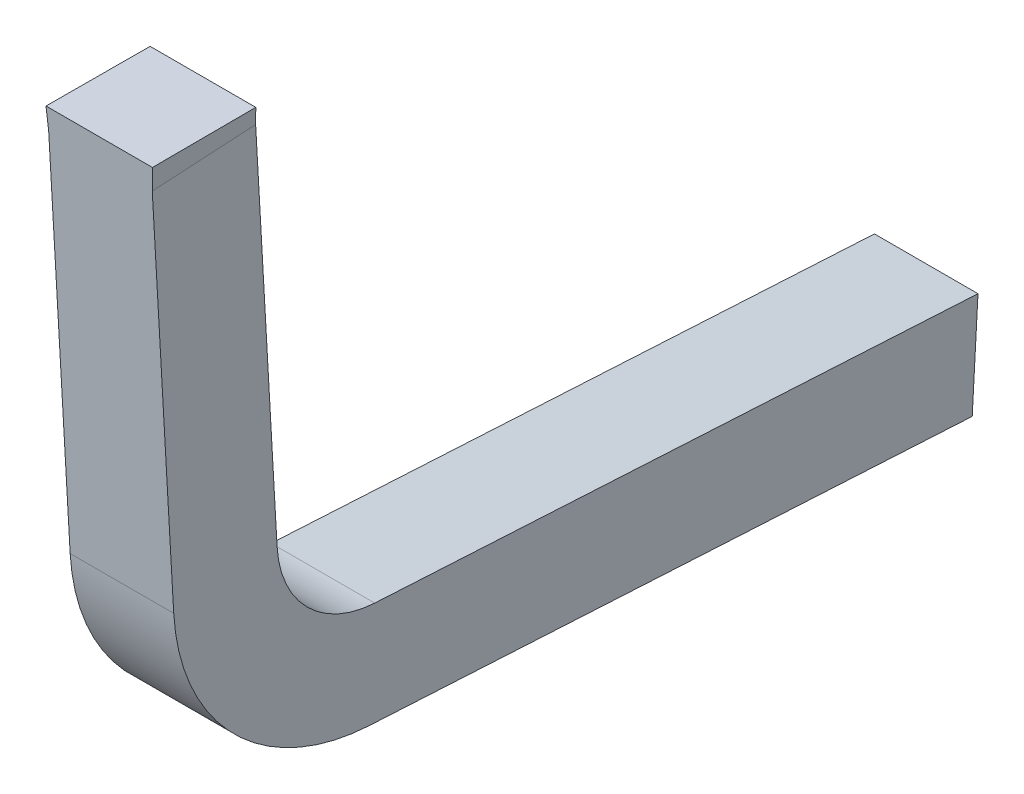
ISO-10303-21;
HEADER;
FILE_DESCRIPTION(('STEP AP214'),'2;1');
FILE_NAME('part.step','',(''),(''),'','','');
FILE_SCHEMA(('AUTOMOTIVE_DESIGN { 1 0 10303 214 1 1 1 1 }'));
ENDSEC;
DATA;
#1=APPLICATION_CONTEXT('core data for automotive mechanical design processes');
#2=APPLICATION_PROTOCOL_DEFINITION('international standard','automotive_design',2000,#1);
#3=PRODUCT_CONTEXT('',#1,'mechanical');
#4=PRODUCT('Part','Part','',(#3));
#5=PRODUCT_RELATED_PRODUCT_CATEGORY('part','',(#4));
#6=PRODUCT_DEFINITION_FORMATION('','',#4);
#7=PRODUCT_DEFINITION_CONTEXT('part definition',#1,'design');
#8=PRODUCT_DEFINITION('design','',#6,#7);
#9=PRODUCT_DEFINITION_SHAPE('','',#8);
#10=(LENGTH_UNIT() NAMED_UNIT(*) SI_UNIT(.MILLI.,.METRE.));
#11=(NAMED_UNIT(*) PLANE_ANGLE_UNIT() SI_UNIT($,.RADIAN.));
#12=(NAMED_UNIT(*) SI_UNIT($,.STERADIAN.) SOLID_ANGLE_UNIT());
#13=UNCERTAINTY_MEASURE_WITH_UNIT(LENGTH_MEASURE(1.E-05),#10,'distance_accuracy_value','');
#14=(GEOMETRIC_REPRESENTATION_CONTEXT(3) GLOBAL_UNCERTAINTY_ASSIGNED_CONTEXT((#13)) GLOBAL_UNIT_ASSIGNED_CONTEXT((#10,
#11,#12)) REPRESENTATION_CONTEXT('',''));
#15=CARTESIAN_POINT('',(0.,0.,0.));
#16=DIRECTION('',(0.,0.,1.));
#17=DIRECTION('',(1.,0.,0.));
#18=AXIS2_PLACEMENT_3D('',#15,#16,#17);
#19=CARTESIAN_POINT('',(2.398593165818,-2.29897527843,-10.34781984343));
#20=DIRECTION('',(0.997785157857701,0.0664110878974701,0.003787632922693));
#21=DIRECTION('',(-0.0664115642747469,0.997792315129046,0.));
#22=AXIS2_PLACEMENT_3D('',#19,#20,#21);
#23=PLANE('',#22);
#24=DIRECTION('',(0.,-0.0569406083110753,0.998377567418842));
#25=VECTOR('',#24,1.);
#26=CARTESIAN_POINT('',(2.4,-2.314349492935,-10.44885919008));
#27=LINE('',#26,#25);
#28=CARTESIAN_POINT('',(2.4,-2.31434949293492,-10.4488591900814));
#29=VERTEX_POINT('',#28);
#30=CARTESIAN_POINT('',(2.4,-2.32573761459728,-10.2491836765951));
#31=VERTEX_POINT('',#30);
#32=EDGE_CURVE('E98',#29,#31,#27,.T.);
#33=ORIENTED_EDGE('',*,*,#32,.T.);
#34=DIRECTION('',(0.0665190105147783,-0.996166318707982,-0.056814493854309));
#35=VECTOR('',#34,1.);
#36=CARTESIAN_POINT('',(2.397186331635,-2.28360106392498,-10.2467804967704));
#37=LINE('',#36,#35);
#38=CARTESIAN_POINT('',(2.397186331635,-2.28360106392499,-10.2467804967704));
#39=VERTEX_POINT('',#38);
#40=EDGE_CURVE('E148',#39,#31,#37,.T.);
#41=ORIENTED_EDGE('',*,*,#40,.F.);
#42=DIRECTION('',(-0.00379601320157547,0.,0.999992795115932));
#43=VECTOR('',#42,1.);
#44=CARTESIAN_POINT('',(2.397946773511,-2.283601063925,-10.4471055106));
#45=LINE('',#44,#43);
#46=CARTESIAN_POINT('',(2.397946773511,-2.28360106392489,-10.4471055106019));
#47=VERTEX_POINT('',#46);
#48=EDGE_CURVE('E161',#47,#39,#45,.T.);
#49=ORIENTED_EDGE('',*,*,#48,.F.);
#50=DIRECTION('',(0.0665190105273673,-0.996166318707226,-0.0568144938528306));
#51=VECTOR('',#50,1.);
#52=CARTESIAN_POINT('',(2.397946773511,-2.28360106392483,-10.4471055106029));
#53=LINE('',#52,#51);
#54=EDGE_CURVE('E103',#47,#29,#53,.T.);
#55=ORIENTED_EDGE('',*,*,#54,.T.);
#56=EDGE_LOOP('',(#33,#41,#49,#55));
#57=FACE_BOUND('',#56,.T.);
#58=ADVANCED_FACE('F17',(#57),#23,.F.);
#59=CARTESIAN_POINT('',(2.5,-2.283601063925,-10.34694300369));
#60=DIRECTION('',(0.,1.,0.));
#61=DIRECTION('',(0.,0.,1.));
#62=AXIS2_PLACEMENT_3D('',#59,#60,#61);
#63=PLANE('',#62);
#64=DIRECTION('',(1.,0.,0.));
#65=VECTOR('',#64,1.);
#66=CARTESIAN_POINT('',(2.5,-2.28360106392498,-10.2467804967704));
#67=LINE('',#66,#65);
#68=CARTESIAN_POINT('',(2.60281366836524,-2.283601063925,-10.2467804967704));
#69=VERTEX_POINT('',#68);
#70=EDGE_CURVE('E154',#69,#39,#67,.F.);
#71=ORIENTED_EDGE('',*,*,#70,.F.);
#72=DIRECTION('',(0.0037960132042621,-1.7968426456006E-13,0.999992795115921));
#73=VECTOR('',#72,1.);
#74=CARTESIAN_POINT('',(2.6020532264892,-2.28360106392501,-10.4471055106));
#75=LINE('',#74,#73);
#76=CARTESIAN_POINT('',(2.60205322648913,-2.28360106392495,-10.447105510601));
#77=VERTEX_POINT('',#76);
#78=EDGE_CURVE('E119',#77,#69,#75,.T.);
#79=ORIENTED_EDGE('',*,*,#78,.F.);
#80=DIRECTION('',(1.,0.,0.));
#81=VECTOR('',#80,1.);
#82=CARTESIAN_POINT('',(2.5,-2.28360106392483,-10.4471055106029));
#83=LINE('',#82,#81);
#84=EDGE_CURVE('E125',#77,#47,#83,.F.);
#85=ORIENTED_EDGE('',*,*,#84,.T.);
#86=ORIENTED_EDGE('',*,*,#48,.T.);
#87=EDGE_LOOP('',(#71,#79,#85,#86));
#88=FACE_BOUND('',#87,.T.);
#89=ADVANCED_FACE('F243',(#88),#63,.T.);
#90=CARTESIAN_POINT('',(2.4,-2.909472777839,-11.05227927458));
#91=DIRECTION('',(1.,0.,0.));
#92=DIRECTION('',(0.,0.,-1.));
#93=AXIS2_PLACEMENT_3D('',#90,#91,#92);
#94=PLANE('',#93);
#95=CARTESIAN_POINT('',(2.4,-3.03,-10.69));
#96=DIRECTION('',(-1.,0.,0.));
#97=DIRECTION('',(0.,0.,1.));
#98=AXIS2_PLACEMENT_3D('',#95,#96,#97);
#99=CIRCLE('',#98,0.4);
#100=CARTESIAN_POINT('',(2.4,-3.05277624331319,-10.2906489730306));
#101=VERTEX_POINT('',#100);
#102=CARTESIAN_POINT('',(2.4,-3.42937693582933,-10.6676826720305));
#103=VERTEX_POINT('',#102);
#104=EDGE_CURVE('E142',#101,#103,#99,.F.);
#105=ORIENTED_EDGE('',*,*,#104,.F.);
#106=DIRECTION('',(0.,-0.998377567418718,-0.056940608313261));
#107=VECTOR('',#106,1.);
#108=CARTESIAN_POINT('',(2.4,-2.668188653621,-10.2687147349));
#109=LINE('',#108,#107);
#110=EDGE_CURVE('E145',#31,#101,#109,.T.);
#111=ORIENTED_EDGE('',*,*,#110,.F.);
#112=ORIENTED_EDGE('',*,*,#32,.F.);
#113=DIRECTION('',(0.,-0.998377567418801,-0.0569406083117901));
#114=VECTOR('',#113,1.);
#115=CARTESIAN_POINT('',(2.4,-2.662494592804,-10.46871499856));
#116=LINE('',#115,#114);
#117=CARTESIAN_POINT('',(2.4,-3.04138812167726,-10.4903244865168));
#118=VERTEX_POINT('',#117);
#119=EDGE_CURVE('E92',#29,#118,#116,.T.);
#120=ORIENTED_EDGE('',*,*,#119,.T.);
#121=CARTESIAN_POINT('',(2.4,-3.03,-10.69));
#122=DIRECTION('',(-1.,0.,0.));
#123=DIRECTION('',(0.,0.,1.));
#124=AXIS2_PLACEMENT_3D('',#121,#122,#123);
#125=CIRCLE('',#124,0.2);
#126=CARTESIAN_POINT('',(2.4,-3.22968846791482,-10.6788413360177));
#127=VERTEX_POINT('',#126);
#128=EDGE_CURVE('E20',#118,#127,#125,.F.);
#129=ORIENTED_EDGE('',*,*,#128,.T.);
#130=DIRECTION('',(0.,0.0557933199228295,0.998442339572991));
#131=VECTOR('',#130,1.);
#132=CARTESIAN_POINT('',(2.4,-3.262244863925,-11.26145022621));
#133=LINE('',#132,#131);
#134=CARTESIAN_POINT('',(2.4,-3.29480125993501,-11.8440591164004));
#135=VERTEX_POINT('',#134);
#136=EDGE_CURVE('E111',#135,#127,#133,.T.);
#137=ORIENTED_EDGE('',*,*,#136,.F.);
#138=DIRECTION('',(0.,-0.998442339574031,0.0557933199042218));
#139=VECTOR('',#138,1.);
#140=CARTESIAN_POINT('',(2.4,-3.394645493892,-11.83847978441));
#141=LINE('',#140,#139);
#142=CARTESIAN_POINT('',(2.4,-3.49448972784906,-11.8329004524196));
#143=VERTEX_POINT('',#142);
#144=EDGE_CURVE('E135',#135,#143,#141,.T.);
#145=ORIENTED_EDGE('',*,*,#144,.T.);
#146=DIRECTION('',(0.,0.055793319922371,0.998442339573017));
#147=VECTOR('',#146,1.);
#148=CARTESIAN_POINT('',(2.4,-3.461933331839,-11.25029156222));
#149=LINE('',#148,#147);
#150=EDGE_CURVE('E140',#143,#103,#149,.T.);
#151=ORIENTED_EDGE('',*,*,#150,.T.);
#152=EDGE_LOOP('',(#105,#111,#112,#120,#129,#137,#145,#151));
#153=FACE_BOUND('',#152,.T.);
#154=ADVANCED_FACE('F95',(#153),#94,.F.);
#155=CARTESIAN_POINT('',(2.5,-3.262244863925,-11.26145022621));
#156=DIRECTION('',(0.,0.998442339572991,-0.0557933199228295));
#157=DIRECTION('',(0.,0.0557933199228295,0.998442339572991));
#158=AXIS2_PLACEMENT_3D('',#155,#156,#157);
#159=PLANE('',#158);
#160=DIRECTION('',(0.,0.055793319922887,0.998442339572988));
#161=VECTOR('',#160,1.);
#162=CARTESIAN_POINT('',(2.6,-3.294801259935,-11.8440591164));
#163=LINE('',#162,#161);
#164=CARTESIAN_POINT('',(2.6,-3.29480125993501,-11.8440591164001));
#165=VERTEX_POINT('',#164);
#166=CARTESIAN_POINT('',(2.6,-3.2296884679148,-10.6788413360177));
#167=VERTEX_POINT('',#166);
#168=EDGE_CURVE('E129',#165,#167,#163,.T.);
#169=ORIENTED_EDGE('',*,*,#168,.F.);
#170=DIRECTION('',(1.,0.,0.));
#171=VECTOR('',#170,1.);
#172=CARTESIAN_POINT('',(2.5,-3.29480125993502,-11.8440591164004));
#173=LINE('',#172,#171);
#174=EDGE_CURVE('E126',#165,#135,#173,.F.);
#175=ORIENTED_EDGE('',*,*,#174,.T.);
#176=ORIENTED_EDGE('',*,*,#136,.T.);
#177=DIRECTION('',(-1.,0.,0.));
#178=VECTOR('',#177,1.);
#179=CARTESIAN_POINT('',(2.604,-3.22968846791485,-10.67884133602));
#180=LINE('',#179,#178);
#181=EDGE_CURVE('E110',#127,#167,#180,.F.);
#182=ORIENTED_EDGE('',*,*,#181,.T.);
#183=EDGE_LOOP('',(#169,#175,#176,#182));
#184=FACE_BOUND('',#183,.T.);
#185=ADVANCED_FACE('F234',(#184),#159,.T.);
#186=CARTESIAN_POINT('',(2.604,-3.03,-10.69));
#187=DIRECTION('',(-1.,0.,0.));
#188=DIRECTION('',(0.,0.,1.));
#189=AXIS2_PLACEMENT_3D('',#186,#187,#188);
#190=CYLINDRICAL_SURFACE('',#189,0.2);
#191=ORIENTED_EDGE('',*,*,#128,.F.);
#192=DIRECTION('',(1.,0.,0.));
#193=VECTOR('',#192,1.);
#194=CARTESIAN_POINT('',(2.5,-3.04138812169214,-10.4903244865176));
#195=LINE('',#194,#193);
#196=CARTESIAN_POINT('',(2.6,-3.04138812167779,-10.490324486518));
#197=VERTEX_POINT('',#196);
#198=EDGE_CURVE('E102',#118,#197,#195,.T.);
#199=ORIENTED_EDGE('',*,*,#198,.T.);
#200=CARTESIAN_POINT('',(2.6,-3.03,-10.69));
#201=DIRECTION('',(-1.,0.,0.));
#202=DIRECTION('',(0.,0.,1.));
#203=AXIS2_PLACEMENT_3D('',#200,#201,#202);
#204=CIRCLE('',#203,0.2);
#205=EDGE_CURVE('E185',#167,#197,#204,.T.);
#206=ORIENTED_EDGE('',*,*,#205,.F.);
#207=ORIENTED_EDGE('',*,*,#181,.F.);
#208=EDGE_LOOP('',(#191,#199,#206,#207));
#209=FACE_BOUND('',#208,.T.);
#210=ADVANCED_FACE('F107',(#209),#190,.F.);
#211=CARTESIAN_POINT('',(2.5,-2.662494592804,-10.46871499856));
#212=DIRECTION('',(0.,-0.0569406083117901,0.998377567418801));
#213=DIRECTION('',(0.,-0.998377567418801,-0.0569406083117901));
#214=AXIS2_PLACEMENT_3D('',#211,#212,#213);
#215=PLANE('',#214);
#216=DIRECTION('',(0.,0.998377567418456,0.0569406083178453));
#217=VECTOR('',#216,1.);
#218=CARTESIAN_POINT('',(2.6,-3.041388121692,-10.49032448652));
#219=LINE('',#218,#217);
#220=CARTESIAN_POINT('',(2.60000000000008,-2.314349492934,-10.44885919008));
#221=VERTEX_POINT('',#220);
#222=EDGE_CURVE('E114',#197,#221,#219,.T.);
#223=ORIENTED_EDGE('',*,*,#222,.F.);
#224=ORIENTED_EDGE('',*,*,#198,.F.);
#225=ORIENTED_EDGE('',*,*,#119,.F.);
#226=ORIENTED_EDGE('',*,*,#54,.F.);
#227=ORIENTED_EDGE('',*,*,#84,.F.);
#228=DIRECTION('',(0.0665190105284185,0.996166318705548,0.0568144938810224));
#229=VECTOR('',#228,1.);
#230=CARTESIAN_POINT('',(2.60000000000023,-2.31434949293401,-10.44885919008));
#231=LINE('',#230,#229);
#232=EDGE_CURVE('E116',#221,#77,#231,.T.);
#233=ORIENTED_EDGE('',*,*,#232,.F.);
#234=EDGE_LOOP('',(#223,#224,#225,#226,#227,#233));
#235=FACE_BOUND('',#234,.T.);
#236=ADVANCED_FACE('F112',(#235),#215,.F.);
#237=CARTESIAN_POINT('',(2.601406834183,-2.298975278429,-10.34781984343));
#238=DIRECTION('',(0.9977851578563,-0.06641108791847,-0.003787632923708));
#239=DIRECTION('',(0.0664115642957472,0.997792315127648,0.));
#240=AXIS2_PLACEMENT_3D('',#237,#238,#239);
#241=PLANE('',#240);
#242=ORIENTED_EDGE('',*,*,#232,.T.);
#243=ORIENTED_EDGE('',*,*,#78,.T.);
#244=DIRECTION('',(0.0665190105179116,0.996166318707773,0.0568144938543194));
#245=VECTOR('',#244,1.);
#246=CARTESIAN_POINT('',(2.6,-2.32573761459528,-10.249183676595));
#247=LINE('',#246,#245);
#248=CARTESIAN_POINT('',(2.6,-2.32573761459509,-10.2491836765983));
#249=VERTEX_POINT('',#248);
#250=EDGE_CURVE('E147',#249,#69,#247,.T.);
#251=ORIENTED_EDGE('',*,*,#250,.F.);
#252=DIRECTION('',(0.,-0.0569406083060912,0.998377567419126));
#253=VECTOR('',#252,1.);
#254=CARTESIAN_POINT('',(2.6,-2.314349492934,-10.44885919008));
#255=LINE('',#254,#253);
#256=EDGE_CURVE('E200',#221,#249,#255,.T.);
#257=ORIENTED_EDGE('',*,*,#256,.F.);
#258=EDGE_LOOP('',(#242,#243,#251,#257));
#259=FACE_BOUND('',#258,.T.);
#260=ADVANCED_FACE('F258',(#259),#241,.T.);
#261=CARTESIAN_POINT('',(2.5,-2.668188653621,-10.2687147349));
#262=DIRECTION('',(0.,-0.056940608313261,0.998377567418718));
#263=DIRECTION('',(0.,-0.998377567418718,-0.056940608313261));
#264=AXIS2_PLACEMENT_3D('',#261,#262,#263);
#265=PLANE('',#264);
#266=ORIENTED_EDGE('',*,*,#250,.T.);
#267=ORIENTED_EDGE('',*,*,#70,.T.);
#268=ORIENTED_EDGE('',*,*,#40,.T.);
#269=ORIENTED_EDGE('',*,*,#110,.T.);
#270=DIRECTION('',(-1.,0.,0.));
#271=VECTOR('',#270,1.);
#272=CARTESIAN_POINT('',(2.604,-3.05277624330094,-10.2906489730311));
#273=LINE('',#272,#271);
#274=CARTESIAN_POINT('',(2.6,-3.05277624331214,-10.2906489730312));
#275=VERTEX_POINT('',#274);
#276=EDGE_CURVE('E157',#275,#101,#273,.T.);
#277=ORIENTED_EDGE('',*,*,#276,.F.);
#278=DIRECTION('',(0.,-0.998377567419005,-0.0569406083082185));
#279=VECTOR('',#278,1.);
#280=CARTESIAN_POINT('',(2.6,-2.325737614595,-10.2491836766));
#281=LINE('',#280,#279);
#282=EDGE_CURVE('E184',#249,#275,#281,.T.);
#283=ORIENTED_EDGE('',*,*,#282,.F.);
#284=EDGE_LOOP('',(#266,#267,#268,#269,#277,#283));
#285=FACE_BOUND('',#284,.T.);
#286=ADVANCED_FACE('F227',(#285),#265,.T.);
#287=CARTESIAN_POINT('',(2.604,-3.03,-10.69));
#288=DIRECTION('',(-1.,0.,0.));
#289=DIRECTION('',(0.,0.,1.));
#290=AXIS2_PLACEMENT_3D('',#287,#288,#289);
#291=CYLINDRICAL_SURFACE('',#290,0.4);
#292=DIRECTION('',(1.,0.,0.));
#293=VECTOR('',#292,1.);
#294=CARTESIAN_POINT('',(2.5,-3.4293769358293,-10.66768267203));
#295=LINE('',#294,#293);
#296=CARTESIAN_POINT('',(2.6,-3.42937693582946,-10.6676826720306));
#297=VERTEX_POINT('',#296);
#298=EDGE_CURVE('E137',#103,#297,#295,.T.);
#299=ORIENTED_EDGE('',*,*,#298,.T.);
#300=CARTESIAN_POINT('',(2.6,-3.03,-10.69));
#301=DIRECTION('',(-1.,0.,0.));
#302=DIRECTION('',(0.,0.,1.));
#303=AXIS2_PLACEMENT_3D('',#300,#301,#302);
#304=CIRCLE('',#303,0.4);
#305=EDGE_CURVE('E181',#275,#297,#304,.F.);
#306=ORIENTED_EDGE('',*,*,#305,.F.);
#307=ORIENTED_EDGE('',*,*,#276,.T.);
#308=ORIENTED_EDGE('',*,*,#104,.T.);
#309=EDGE_LOOP('',(#299,#306,#307,#308));
#310=FACE_BOUND('',#309,.T.);
#311=ADVANCED_FACE('F220',(#310),#291,.T.);
#312=CARTESIAN_POINT('',(2.5,-3.461933331839,-11.25029156222));
#313=DIRECTION('',(0.,0.998442339573017,-0.055793319922371));
#314=DIRECTION('',(0.,0.055793319922371,0.998442339573017));
#315=AXIS2_PLACEMENT_3D('',#312,#313,#314);
#316=PLANE('',#315);
#317=ORIENTED_EDGE('',*,*,#298,.F.);
#318=ORIENTED_EDGE('',*,*,#150,.F.);
#319=DIRECTION('',(1.,0.,0.));
#320=VECTOR('',#319,1.);
#321=CARTESIAN_POINT('',(2.5,-3.49448972784898,-11.8329004524196));
#322=LINE('',#321,#320);
#323=CARTESIAN_POINT('',(2.6,-3.49448972784899,-11.8329004524199));
#324=VERTEX_POINT('',#323);
#325=EDGE_CURVE('E35',#143,#324,#322,.T.);
#326=ORIENTED_EDGE('',*,*,#325,.T.);
#327=DIRECTION('',(0.,-0.0557933199219327,-0.998442339573042));
#328=VECTOR('',#327,1.);
#329=CARTESIAN_POINT('',(2.6,-3.429376935829,-10.66768267202));
#330=LINE('',#329,#328);
#331=EDGE_CURVE('E26',#297,#324,#330,.T.);
#332=ORIENTED_EDGE('',*,*,#331,.F.);
#333=EDGE_LOOP('',(#317,#318,#326,#332));
#334=FACE_BOUND('',#333,.T.);
#335=ADVANCED_FACE('F222',(#334),#316,.F.);
#336=CARTESIAN_POINT('',(2.5,-3.394645493892,-11.83847978441));
#337=DIRECTION('',(0.,0.0557933199042218,0.998442339574031));
#338=DIRECTION('',(0.,-0.998442339574031,0.0557933199042218));
#339=AXIS2_PLACEMENT_3D('',#336,#337,#338);
#340=PLANE('',#339);
#341=DIRECTION('',(0.,0.998442339574254,-0.0557933199002383));
#342=VECTOR('',#341,1.);
#343=CARTESIAN_POINT('',(2.6,-3.494489727849,-11.83290045242));
#344=LINE('',#343,#342);
#345=EDGE_CURVE('E11',#324,#165,#344,.T.);
#346=ORIENTED_EDGE('',*,*,#345,.F.);
#347=ORIENTED_EDGE('',*,*,#325,.F.);
#348=ORIENTED_EDGE('',*,*,#144,.F.);
#349=ORIENTED_EDGE('',*,*,#174,.F.);
#350=EDGE_LOOP('',(#346,#347,#348,#349));
#351=FACE_BOUND('',#350,.T.);
#352=ADVANCED_FACE('F230',(#351),#340,.F.);
#353=CARTESIAN_POINT('',(2.6,-2.909472777838,-11.05227927458));
#354=DIRECTION('',(1.,0.,0.));
#355=DIRECTION('',(0.,0.,-1.));
#356=AXIS2_PLACEMENT_3D('',#353,#354,#355);
#357=PLANE('',#356);
#358=ORIENTED_EDGE('',*,*,#331,.T.);
#359=ORIENTED_EDGE('',*,*,#345,.T.);
#360=ORIENTED_EDGE('',*,*,#168,.T.);
#361=ORIENTED_EDGE('',*,*,#205,.T.);
#362=ORIENTED_EDGE('',*,*,#222,.T.);
#363=ORIENTED_EDGE('',*,*,#256,.T.);
#364=ORIENTED_EDGE('',*,*,#282,.T.);
#365=ORIENTED_EDGE('',*,*,#305,.T.);
#366=EDGE_LOOP('',(#358,#359,#360,#361,#362,#363,#364,#365));
#367=FACE_BOUND('',#366,.T.);
#368=ADVANCED_FACE('F224',(#367),#357,.T.);
#369=CLOSED_SHELL('',(#58,#89,#154,#185,#210,#236,#260,#286,#311,#335,#352,#368));
#370=MANIFOLD_SOLID_BREP('B1',#369);
#371=ADVANCED_BREP_SHAPE_REPRESENTATION('',(#18,#370),#14);
#372=SHAPE_DEFINITION_REPRESENTATION(#9,#371);
ENDSEC;
END-ISO-10303-21;
